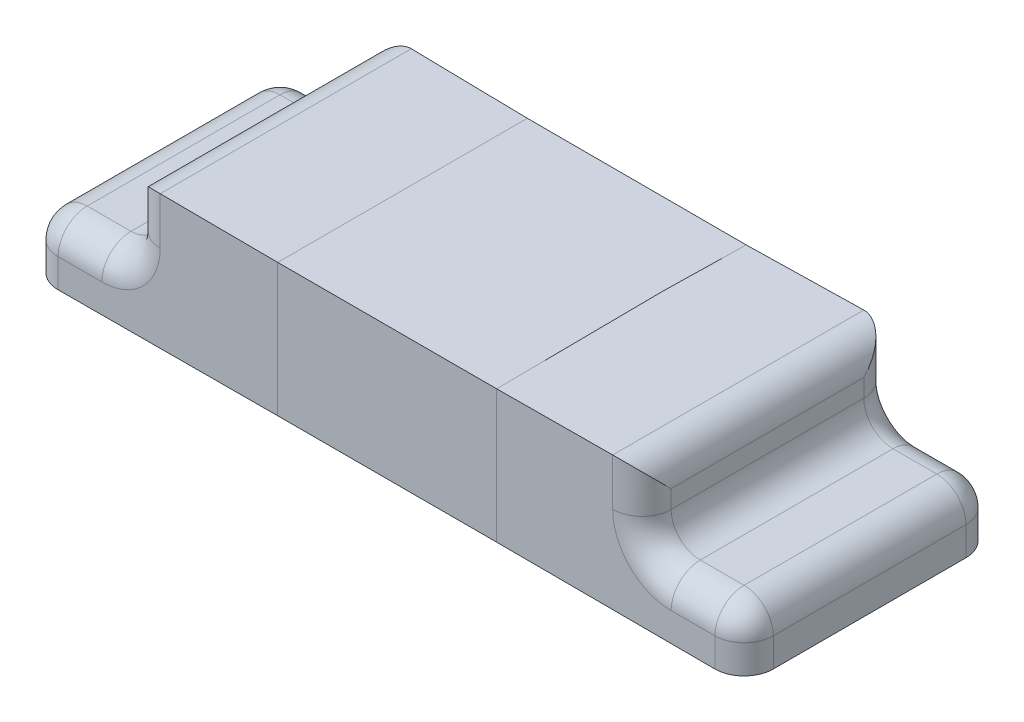
ISO-10303-21;
HEADER;
FILE_DESCRIPTION(('STEP AP214'),'2;1');
FILE_NAME('part.step','',(''),(''),'','','');
FILE_SCHEMA(('AUTOMOTIVE_DESIGN { 1 0 10303 214 1 1 1 1 }'));
ENDSEC;
DATA;
#1=APPLICATION_CONTEXT('core data for automotive mechanical design processes');
#2=APPLICATION_PROTOCOL_DEFINITION('international standard','automotive_design',2000,#1);
#3=PRODUCT_CONTEXT('',#1,'mechanical');
#4=PRODUCT('Part','Part','',(#3));
#5=PRODUCT_RELATED_PRODUCT_CATEGORY('part','',(#4));
#6=PRODUCT_DEFINITION_FORMATION('','',#4);
#7=PRODUCT_DEFINITION_CONTEXT('part definition',#1,'design');
#8=PRODUCT_DEFINITION('design','',#6,#7);
#9=PRODUCT_DEFINITION_SHAPE('','',#8);
#10=(LENGTH_UNIT() NAMED_UNIT(*) SI_UNIT(.MILLI.,.METRE.));
#11=(NAMED_UNIT(*) PLANE_ANGLE_UNIT() SI_UNIT($,.RADIAN.));
#12=(NAMED_UNIT(*) SI_UNIT($,.STERADIAN.) SOLID_ANGLE_UNIT());
#13=UNCERTAINTY_MEASURE_WITH_UNIT(LENGTH_MEASURE(1.E-05),#10,'distance_accuracy_value','');
#14=(GEOMETRIC_REPRESENTATION_CONTEXT(3) GLOBAL_UNCERTAINTY_ASSIGNED_CONTEXT((#13)) GLOBAL_UNIT_ASSIGNED_CONTEXT((#10,
#11,#12)) REPRESENTATION_CONTEXT('',''));
#15=CARTESIAN_POINT('',(0.,0.,0.));
#16=DIRECTION('',(0.,0.,1.));
#17=DIRECTION('',(1.,0.,0.));
#18=AXIS2_PLACEMENT_3D('',#15,#16,#17);
#19=CARTESIAN_POINT('',(0.875,0.,0.));
#20=DIRECTION('',(-1.,0.,0.));
#21=DIRECTION('',(0.,0.,1.));
#22=AXIS2_PLACEMENT_3D('',#19,#20,#21);
#23=PLANE('',#22);
#24=DIRECTION('',(0.,1.,0.));
#25=VECTOR('',#24,1.);
#26=CARTESIAN_POINT('',(0.875,0.,-0.33));
#27=LINE('',#26,#25);
#28=CARTESIAN_POINT('',(0.875,0.298442990090282,-0.33));
#29=VERTEX_POINT('',#28);
#30=CARTESIAN_POINT('',(0.875,0.36,-0.33));
#31=VERTEX_POINT('',#30);
#32=EDGE_CURVE('E507',#29,#31,#27,.T.);
#33=ORIENTED_EDGE('',*,*,#32,.T.);
#34=DIRECTION('',(0.,0.,1.));
#35=VECTOR('',#34,1.);
#36=CARTESIAN_POINT('',(0.875,0.36,0.));
#37=LINE('',#36,#35);
#38=CARTESIAN_POINT('',(0.875,0.36,0.33));
#39=VERTEX_POINT('',#38);
#40=EDGE_CURVE('E482',#31,#39,#37,.T.);
#41=ORIENTED_EDGE('',*,*,#40,.T.);
#42=DIRECTION('',(0.,-1.,0.));
#43=VECTOR('',#42,1.);
#44=CARTESIAN_POINT('',(0.875,0.,0.33));
#45=LINE('',#44,#43);
#46=CARTESIAN_POINT('',(0.875,0.298442990090282,0.33));
#47=VERTEX_POINT('',#46);
#48=EDGE_CURVE('E510',#39,#47,#45,.T.);
#49=ORIENTED_EDGE('',*,*,#48,.T.);
#50=DIRECTION('',(0.,0.,1.));
#51=VECTOR('',#50,1.);
#52=CARTESIAN_POINT('',(0.875,0.298442990090282,-0.43));
#53=LINE('',#52,#51);
#54=EDGE_CURVE('E272',#47,#29,#53,.F.);
#55=ORIENTED_EDGE('',*,*,#54,.T.);
#56=EDGE_LOOP('',(#33,#41,#49,#55));
#57=FACE_BOUND('',#56,.T.);
#58=ADVANCED_FACE('F39',(#57),#23,.F.);
#59=CARTESIAN_POINT('',(0.375,0.,-0.425));
#60=DIRECTION('',(0.,0.,1.));
#61=DIRECTION('',(1.,0.,0.));
#62=AXIS2_PLACEMENT_3D('',#59,#60,#61);
#63=PLANE('',#62);
#64=CARTESIAN_POINT('',(-0.375,0.,-0.425));
#65=DIRECTION('',(0.,1.,0.));
#66=VECTOR('',#65,1.);
#67=LINE('',#64,#66);
#68=CARTESIAN_POINT('',(-0.375,0.,-0.4275));
#69=VERTEX_POINT('',#68);
#70=CARTESIAN_POINT('',(-0.375,0.455,-0.4275));
#71=VERTEX_POINT('',#70);
#72=EDGE_CURVE('E232',#69,#71,#67,.T.);
#73=ORIENTED_EDGE('',*,*,#72,.T.);
#74=DIRECTION('',(-1.,0.,0.));
#75=VECTOR('',#74,1.);
#76=CARTESIAN_POINT('',(0.375,0.45,-0.425));
#77=LINE('',#76,#75);
#78=CARTESIAN_POINT('',(0.375,0.454472135955,-0.4272360679775));
#79=VERTEX_POINT('',#78);
#80=EDGE_CURVE('E269',#79,#71,#77,.T.);
#81=ORIENTED_EDGE('',*,*,#80,.F.);
#82=CARTESIAN_POINT('',(0.375,0.,-0.43));
#83=DIRECTION('',(0.,1.,0.));
#84=VECTOR('',#83,1.);
#85=LINE('',#82,#84);
#86=CARTESIAN_POINT('',(0.375,0.,-0.4275));
#87=VERTEX_POINT('',#86);
#88=EDGE_CURVE('E248',#87,#79,#85,.T.);
#89=ORIENTED_EDGE('',*,*,#88,.F.);
#90=DIRECTION('',(-1.,0.,0.));
#91=VECTOR('',#90,1.);
#92=CARTESIAN_POINT('',(0.375,0.,-0.425));
#93=LINE('',#92,#91);
#94=EDGE_CURVE('E221',#87,#69,#93,.T.);
#95=ORIENTED_EDGE('',*,*,#94,.T.);
#96=EDGE_LOOP('',(#73,#81,#89,#95));
#97=FACE_BOUND('',#96,.T.);
#98=ADVANCED_FACE('F246',(#97),#63,.F.);
#99=CARTESIAN_POINT('',(0.375,0.45,0.425));
#100=DIRECTION('',(0.,-1.,0.));
#101=DIRECTION('',(0.,0.,-1.));
#102=AXIS2_PLACEMENT_3D('',#99,#100,#101);
#103=PLANE('',#102);
#104=CARTESIAN_POINT('',(-0.375,0.45,-0.425));
#105=DIRECTION('',(0.,0.,1.));
#106=VECTOR('',#105,1.);
#107=LINE('',#104,#106);
#108=CARTESIAN_POINT('',(-0.375,0.455,0.4275));
#109=VERTEX_POINT('',#108);
#110=EDGE_CURVE('E242',#71,#109,#107,.T.);
#111=ORIENTED_EDGE('',*,*,#110,.T.);
#112=DIRECTION('',(-1.,0.,0.));
#113=VECTOR('',#112,1.);
#114=CARTESIAN_POINT('',(0.375,0.45,0.425));
#115=LINE('',#114,#113);
#116=CARTESIAN_POINT('',(0.375,0.455,0.4275));
#117=VERTEX_POINT('',#116);
#118=EDGE_CURVE('E254',#117,#109,#115,.T.);
#119=ORIENTED_EDGE('',*,*,#118,.F.);
#120=DIRECTION('',(0.,0.,1.));
#121=VECTOR('',#120,1.);
#122=CARTESIAN_POINT('',(0.375,0.45,0.425));
#123=LINE('',#122,#121);
#124=EDGE_CURVE('E257',#79,#117,#123,.T.);
#125=ORIENTED_EDGE('',*,*,#124,.F.);
#126=ORIENTED_EDGE('',*,*,#80,.T.);
#127=EDGE_LOOP('',(#111,#119,#125,#126));
#128=FACE_BOUND('',#127,.T.);
#129=ADVANCED_FACE('F296',(#128),#103,.F.);
#130=CARTESIAN_POINT('',(0.375,0.,0.425));
#131=DIRECTION('',(0.,0.,-1.));
#132=DIRECTION('',(-1.,0.,0.));
#133=AXIS2_PLACEMENT_3D('',#130,#131,#132);
#134=PLANE('',#133);
#135=CARTESIAN_POINT('',(-0.375,0.45,0.425));
#136=DIRECTION('',(0.,-1.,0.));
#137=VECTOR('',#136,1.);
#138=LINE('',#135,#137);
#139=CARTESIAN_POINT('',(-0.375,0.,0.4275));
#140=VERTEX_POINT('',#139);
#141=EDGE_CURVE('E337',#109,#140,#138,.T.);
#142=ORIENTED_EDGE('',*,*,#141,.T.);
#143=DIRECTION('',(-1.,0.,0.));
#144=VECTOR('',#143,1.);
#145=CARTESIAN_POINT('',(0.375,0.,0.425));
#146=LINE('',#145,#144);
#147=CARTESIAN_POINT('',(0.375,0.,0.4275));
#148=VERTEX_POINT('',#147);
#149=EDGE_CURVE('E250',#148,#140,#146,.T.);
#150=ORIENTED_EDGE('',*,*,#149,.F.);
#151=CARTESIAN_POINT('',(0.375,0.46,0.43));
#152=DIRECTION('',(0.,-1.,0.));
#153=VECTOR('',#152,1.);
#154=LINE('',#151,#153);
#155=EDGE_CURVE('E251',#117,#148,#154,.T.);
#156=ORIENTED_EDGE('',*,*,#155,.F.);
#157=ORIENTED_EDGE('',*,*,#118,.T.);
#158=EDGE_LOOP('',(#142,#150,#156,#157));
#159=FACE_BOUND('',#158,.T.);
#160=ADVANCED_FACE('F286',(#159),#134,.F.);
#161=CARTESIAN_POINT('',(0.375,0.,0.425));
#162=DIRECTION('',(0.,1.,0.));
#163=DIRECTION('',(0.,0.,1.));
#164=AXIS2_PLACEMENT_3D('',#161,#162,#163);
#165=PLANE('',#164);
#166=DIRECTION('',(0.,0.,-1.));
#167=VECTOR('',#166,1.);
#168=CARTESIAN_POINT('',(-1.225,0.,0.43));
#169=LINE('',#168,#167);
#170=CARTESIAN_POINT('',(-1.225,0.,0.33));
#171=VERTEX_POINT('',#170);
#172=CARTESIAN_POINT('',(-1.225,0.,-0.33));
#173=VERTEX_POINT('',#172);
#174=EDGE_CURVE('E326',#171,#173,#169,.T.);
#175=ORIENTED_EDGE('',*,*,#174,.T.);
#176=CARTESIAN_POINT('',(-1.125,0.,-0.33));
#177=DIRECTION('',(0.,1.,0.));
#178=DIRECTION('',(0.,0.,1.));
#179=AXIS2_PLACEMENT_3D('',#176,#177,#178);
#180=CIRCLE('',#179,0.1);
#181=CARTESIAN_POINT('',(-1.125,0.,-0.43));
#182=VERTEX_POINT('',#181);
#183=EDGE_CURVE('E224',#173,#182,#180,.F.);
#184=ORIENTED_EDGE('',*,*,#183,.T.);
#185=DIRECTION('',(1.,0.,0.));
#186=VECTOR('',#185,1.);
#187=CARTESIAN_POINT('',(-0.875,0.,-0.43));
#188=LINE('',#187,#186);
#189=EDGE_CURVE('E215',#182,#69,#188,.T.);
#190=ORIENTED_EDGE('',*,*,#189,.T.);
#191=ORIENTED_EDGE('',*,*,#94,.F.);
#192=DIRECTION('',(-1.,0.,0.));
#193=VECTOR('',#192,1.);
#194=CARTESIAN_POINT('',(0.875,0.,-0.43));
#195=LINE('',#194,#193);
#196=CARTESIAN_POINT('',(1.125,0.,-0.43));
#197=VERTEX_POINT('',#196);
#198=EDGE_CURVE('E464',#197,#87,#195,.T.);
#199=ORIENTED_EDGE('',*,*,#198,.F.);
#200=CARTESIAN_POINT('',(1.125,0.,-0.33));
#201=DIRECTION('',(0.,1.,0.));
#202=DIRECTION('',(0.,0.,1.));
#203=AXIS2_PLACEMENT_3D('',#200,#201,#202);
#204=CIRCLE('',#203,0.1);
#205=CARTESIAN_POINT('',(1.225,0.,-0.33));
#206=VERTEX_POINT('',#205);
#207=EDGE_CURVE('E662',#197,#206,#204,.F.);
#208=ORIENTED_EDGE('',*,*,#207,.T.);
#209=DIRECTION('',(0.,0.,-1.));
#210=VECTOR('',#209,1.);
#211=CARTESIAN_POINT('',(1.225,0.,0.43));
#212=LINE('',#211,#210);
#213=CARTESIAN_POINT('',(1.225,0.,0.33));
#214=VERTEX_POINT('',#213);
#215=EDGE_CURVE('E457',#214,#206,#212,.T.);
#216=ORIENTED_EDGE('',*,*,#215,.F.);
#217=CARTESIAN_POINT('',(1.125,0.,0.33));
#218=DIRECTION('',(0.,1.,0.));
#219=DIRECTION('',(0.,0.,1.));
#220=AXIS2_PLACEMENT_3D('',#217,#218,#219);
#221=CIRCLE('',#220,0.1);
#222=CARTESIAN_POINT('',(1.125,0.,0.43));
#223=VERTEX_POINT('',#222);
#224=EDGE_CURVE('E658',#214,#223,#221,.F.);
#225=ORIENTED_EDGE('',*,*,#224,.T.);
#226=DIRECTION('',(-1.,0.,0.));
#227=VECTOR('',#226,1.);
#228=CARTESIAN_POINT('',(0.875,0.,0.43));
#229=LINE('',#228,#227);
#230=EDGE_CURVE('E408',#223,#148,#229,.T.);
#231=ORIENTED_EDGE('',*,*,#230,.T.);
#232=ORIENTED_EDGE('',*,*,#149,.T.);
#233=DIRECTION('',(1.,0.,0.));
#234=VECTOR('',#233,1.);
#235=CARTESIAN_POINT('',(-0.875,0.,0.43));
#236=LINE('',#235,#234);
#237=CARTESIAN_POINT('',(-1.125,0.,0.43));
#238=VERTEX_POINT('',#237);
#239=EDGE_CURVE('E229',#238,#140,#236,.T.);
#240=ORIENTED_EDGE('',*,*,#239,.F.);
#241=CARTESIAN_POINT('',(-1.125,0.,0.33));
#242=DIRECTION('',(0.,1.,0.));
#243=DIRECTION('',(0.,0.,1.));
#244=AXIS2_PLACEMENT_3D('',#241,#242,#243);
#245=CIRCLE('',#244,0.1);
#246=EDGE_CURVE('E62',#238,#171,#245,.F.);
#247=ORIENTED_EDGE('',*,*,#246,.T.);
#248=EDGE_LOOP('',(#175,#184,#190,#191,#199,#208,#216,#225,#231,#232,#240,#247));
#249=FACE_BOUND('',#248,.T.);
#250=ADVANCED_FACE('F218',(#249),#165,.F.);
#251=CARTESIAN_POINT('',(0.875,0.,-0.43));
#252=DIRECTION('',(0.,0.,1.));
#253=DIRECTION('',(1.,0.,0.));
#254=AXIS2_PLACEMENT_3D('',#251,#252,#253);
#255=PLANE('',#254);
#256=DIRECTION('',(-1.,0.,0.));
#257=VECTOR('',#256,1.);
#258=CARTESIAN_POINT('',(0.875,0.098442990090282,-0.43));
#259=LINE('',#258,#257);
#260=CARTESIAN_POINT('',(0.975,0.098442990090282,-0.43));
#261=VERTEX_POINT('',#260);
#262=CARTESIAN_POINT('',(1.125,0.098442990090282,-0.43));
#263=VERTEX_POINT('',#262);
#264=EDGE_CURVE('E484',#261,#263,#259,.F.);
#265=ORIENTED_EDGE('',*,*,#264,.T.);
#266=DIRECTION('',(0.,1.,0.));
#267=VECTOR('',#266,1.);
#268=CARTESIAN_POINT('',(1.125,0.,-0.43));
#269=LINE('',#268,#267);
#270=EDGE_CURVE('E463',#263,#197,#269,.F.);
#271=ORIENTED_EDGE('',*,*,#270,.T.);
#272=ORIENTED_EDGE('',*,*,#198,.T.);
#273=ORIENTED_EDGE('',*,*,#88,.T.);
#274=DIRECTION('',(-1.,0.,0.));
#275=VECTOR('',#274,1.);
#276=CARTESIAN_POINT('',(0.875,0.46,-0.43));
#277=LINE('',#276,#275);
#278=CARTESIAN_POINT('',(0.775,0.46,-0.43));
#279=VERTEX_POINT('',#278);
#280=EDGE_CURVE('E243',#279,#79,#277,.T.);
#281=ORIENTED_EDGE('',*,*,#280,.F.);
#282=DIRECTION('',(0.,1.,0.));
#283=VECTOR('',#282,1.);
#284=CARTESIAN_POINT('',(0.775,0.,-0.43));
#285=LINE('',#284,#283);
#286=CARTESIAN_POINT('',(0.775,0.298442990090282,-0.43));
#287=VERTEX_POINT('',#286);
#288=EDGE_CURVE('E409',#279,#287,#285,.F.);
#289=ORIENTED_EDGE('',*,*,#288,.T.);
#290=CARTESIAN_POINT('',(0.975,0.298442990090282,-0.43));
#291=DIRECTION('',(0.,0.,1.));
#292=DIRECTION('',(1.,0.,0.));
#293=AXIS2_PLACEMENT_3D('',#290,#291,#292);
#294=CIRCLE('',#293,0.2);
#295=EDGE_CURVE('E486',#261,#287,#294,.F.);
#296=ORIENTED_EDGE('',*,*,#295,.F.);
#297=EDGE_LOOP('',(#265,#271,#272,#273,#281,#289,#296));
#298=FACE_BOUND('',#297,.T.);
#299=ADVANCED_FACE('F494',(#298),#255,.F.);
#300=CARTESIAN_POINT('',(0.875,0.46,0.43));
#301=DIRECTION('',(0.,-1.,0.));
#302=DIRECTION('',(0.,0.,-1.));
#303=AXIS2_PLACEMENT_3D('',#300,#301,#302);
#304=PLANE('',#303);
#305=DIRECTION('',(-1.,0.,0.));
#306=VECTOR('',#305,1.);
#307=CARTESIAN_POINT('',(0.875,0.46,0.43));
#308=LINE('',#307,#306);
#309=CARTESIAN_POINT('',(0.775,0.46,0.43));
#310=VERTEX_POINT('',#309);
#311=EDGE_CURVE('E405',#310,#117,#308,.T.);
#312=ORIENTED_EDGE('',*,*,#311,.F.);
#313=DIRECTION('',(0.,0.,1.));
#314=VECTOR('',#313,1.);
#315=CARTESIAN_POINT('',(0.775,0.46,0.43));
#316=LINE('',#315,#314);
#317=EDGE_CURVE('E418',#310,#279,#316,.F.);
#318=ORIENTED_EDGE('',*,*,#317,.T.);
#319=ORIENTED_EDGE('',*,*,#280,.T.);
#320=DIRECTION('',(0.,0.,1.));
#321=VECTOR('',#320,1.);
#322=CARTESIAN_POINT('',(0.375,0.46,0.43));
#323=LINE('',#322,#321);
#324=EDGE_CURVE('E467',#79,#117,#323,.T.);
#325=ORIENTED_EDGE('',*,*,#324,.T.);
#326=EDGE_LOOP('',(#312,#318,#319,#325));
#327=FACE_BOUND('',#326,.T.);
#328=ADVANCED_FACE('F388',(#327),#304,.F.);
#329=CARTESIAN_POINT('',(0.875,0.,0.43));
#330=DIRECTION('',(0.,0.,-1.));
#331=DIRECTION('',(-1.,0.,0.));
#332=AXIS2_PLACEMENT_3D('',#329,#330,#331);
#333=PLANE('',#332);
#334=ORIENTED_EDGE('',*,*,#230,.F.);
#335=DIRECTION('',(0.,-1.,0.));
#336=VECTOR('',#335,1.);
#337=CARTESIAN_POINT('',(1.125,0.,0.43));
#338=LINE('',#337,#336);
#339=CARTESIAN_POINT('',(1.125,0.098442990090282,0.43));
#340=VERTEX_POINT('',#339);
#341=EDGE_CURVE('E664',#223,#340,#338,.F.);
#342=ORIENTED_EDGE('',*,*,#341,.T.);
#343=DIRECTION('',(-1.,0.,0.));
#344=VECTOR('',#343,1.);
#345=CARTESIAN_POINT('',(0.875,0.098442990090282,0.43));
#346=LINE('',#345,#344);
#347=CARTESIAN_POINT('',(0.975,0.098442990090282,0.43));
#348=VERTEX_POINT('',#347);
#349=EDGE_CURVE('E414',#340,#348,#346,.T.);
#350=ORIENTED_EDGE('',*,*,#349,.T.);
#351=CARTESIAN_POINT('',(0.975,0.298442990090282,0.43));
#352=DIRECTION('',(0.,0.,-1.));
#353=DIRECTION('',(-1.,0.,0.));
#354=AXIS2_PLACEMENT_3D('',#351,#352,#353);
#355=CIRCLE('',#354,0.2);
#356=CARTESIAN_POINT('',(0.775,0.298442990090282,0.43));
#357=VERTEX_POINT('',#356);
#358=EDGE_CURVE('E411',#357,#348,#355,.F.);
#359=ORIENTED_EDGE('',*,*,#358,.F.);
#360=DIRECTION('',(0.,-1.,0.));
#361=VECTOR('',#360,1.);
#362=CARTESIAN_POINT('',(0.775,0.,0.43));
#363=LINE('',#362,#361);
#364=EDGE_CURVE('E416',#357,#310,#363,.F.);
#365=ORIENTED_EDGE('',*,*,#364,.T.);
#366=ORIENTED_EDGE('',*,*,#311,.T.);
#367=ORIENTED_EDGE('',*,*,#155,.T.);
#368=EDGE_LOOP('',(#334,#342,#350,#359,#365,#366,#367));
#369=FACE_BOUND('',#368,.T.);
#370=ADVANCED_FACE('F383',(#369),#333,.F.);
#371=CARTESIAN_POINT('',(0.375,0.,0.));
#372=DIRECTION('',(-1.,0.,0.));
#373=DIRECTION('',(0.,0.,1.));
#374=AXIS2_PLACEMENT_3D('',#371,#372,#373);
#375=PLANE('',#374);
#376=ORIENTED_EDGE('',*,*,#324,.F.);
#377=ORIENTED_EDGE('',*,*,#124,.T.);
#378=EDGE_LOOP('',(#376,#377));
#379=FACE_BOUND('',#378,.T.);
#380=ADVANCED_FACE('F376',(#379),#375,.T.);
#381=CARTESIAN_POINT('',(1.225,0.198442990090282,0.43));
#382=DIRECTION('',(0.,-1.,0.));
#383=DIRECTION('',(0.,0.,-1.));
#384=AXIS2_PLACEMENT_3D('',#381,#382,#383);
#385=PLANE('',#384);
#386=DIRECTION('',(-1.,0.,0.));
#387=VECTOR('',#386,1.);
#388=CARTESIAN_POINT('',(1.225,0.198442990090282,-0.33));
#389=LINE('',#388,#387);
#390=CARTESIAN_POINT('',(1.125,0.198442990090282,-0.33));
#391=VERTEX_POINT('',#390);
#392=CARTESIAN_POINT('',(0.975,0.198442990090282,-0.33));
#393=VERTEX_POINT('',#392);
#394=EDGE_CURVE('E426',#391,#393,#389,.T.);
#395=ORIENTED_EDGE('',*,*,#394,.T.);
#396=DIRECTION('',(0.,0.,1.));
#397=VECTOR('',#396,1.);
#398=CARTESIAN_POINT('',(0.975,0.198442990090282,0.43));
#399=LINE('',#398,#397);
#400=CARTESIAN_POINT('',(0.975,0.198442990090282,0.33));
#401=VERTEX_POINT('',#400);
#402=EDGE_CURVE('E429',#393,#401,#399,.T.);
#403=ORIENTED_EDGE('',*,*,#402,.T.);
#404=DIRECTION('',(-1.,0.,0.));
#405=VECTOR('',#404,1.);
#406=CARTESIAN_POINT('',(1.225,0.198442990090282,0.33));
#407=LINE('',#406,#405);
#408=CARTESIAN_POINT('',(1.125,0.198442990090282,0.33));
#409=VERTEX_POINT('',#408);
#410=EDGE_CURVE('E423',#401,#409,#407,.F.);
#411=ORIENTED_EDGE('',*,*,#410,.T.);
#412=DIRECTION('',(0.,0.,1.));
#413=VECTOR('',#412,1.);
#414=CARTESIAN_POINT('',(1.125,0.198442990090282,0.43));
#415=LINE('',#414,#413);
#416=EDGE_CURVE('E420',#409,#391,#415,.F.);
#417=ORIENTED_EDGE('',*,*,#416,.T.);
#418=EDGE_LOOP('',(#395,#403,#411,#417));
#419=FACE_BOUND('',#418,.T.);
#420=ADVANCED_FACE('F372',(#419),#385,.F.);
#421=CARTESIAN_POINT('',(1.225,0.,0.));
#422=DIRECTION('',(-1.,0.,0.));
#423=DIRECTION('',(0.,0.,1.));
#424=AXIS2_PLACEMENT_3D('',#421,#422,#423);
#425=PLANE('',#424);
#426=ORIENTED_EDGE('',*,*,#215,.T.);
#427=DIRECTION('',(0.,1.,0.));
#428=VECTOR('',#427,1.);
#429=CARTESIAN_POINT('',(1.225,0.,-0.33));
#430=LINE('',#429,#428);
#431=CARTESIAN_POINT('',(1.225,0.098442990090282,-0.33));
#432=VERTEX_POINT('',#431);
#433=EDGE_CURVE('E460',#206,#432,#430,.T.);
#434=ORIENTED_EDGE('',*,*,#433,.T.);
#435=DIRECTION('',(0.,0.,1.));
#436=VECTOR('',#435,1.);
#437=CARTESIAN_POINT('',(1.225,0.098442990090282,0.));
#438=LINE('',#437,#436);
#439=CARTESIAN_POINT('',(1.225,0.098442990090282,0.33));
#440=VERTEX_POINT('',#439);
#441=EDGE_CURVE('E431',#432,#440,#438,.T.);
#442=ORIENTED_EDGE('',*,*,#441,.T.);
#443=DIRECTION('',(0.,-1.,0.));
#444=VECTOR('',#443,1.);
#445=CARTESIAN_POINT('',(1.225,0.,0.33));
#446=LINE('',#445,#444);
#447=EDGE_CURVE('E434',#440,#214,#446,.T.);
#448=ORIENTED_EDGE('',*,*,#447,.T.);
#449=EDGE_LOOP('',(#426,#434,#442,#448));
#450=FACE_BOUND('',#449,.T.);
#451=ADVANCED_FACE('F361',(#450),#425,.F.);
#452=CARTESIAN_POINT('',(0.875,0.098442990090282,0.33));
#453=DIRECTION('',(-1.,0.,0.));
#454=DIRECTION('',(0.,0.,1.));
#455=AXIS2_PLACEMENT_3D('',#452,#453,#454);
#456=CYLINDRICAL_SURFACE('',#455,0.1);
#457=ORIENTED_EDGE('',*,*,#349,.F.);
#458=CARTESIAN_POINT('',(1.125,0.098442990090282,0.33));
#459=DIRECTION('',(-1.,0.,0.));
#460=DIRECTION('',(0.,0.,1.));
#461=AXIS2_PLACEMENT_3D('',#458,#459,#460);
#462=CIRCLE('',#461,0.1);
#463=EDGE_CURVE('E672',#340,#409,#462,.T.);
#464=ORIENTED_EDGE('',*,*,#463,.T.);
#465=ORIENTED_EDGE('',*,*,#410,.F.);
#466=CARTESIAN_POINT('',(0.975,0.098442990090282,0.33));
#467=DIRECTION('',(-1.,0.,0.));
#468=DIRECTION('',(0.,0.,1.));
#469=AXIS2_PLACEMENT_3D('',#466,#467,#468);
#470=CIRCLE('',#469,0.1);
#471=EDGE_CURVE('E454',#348,#401,#470,.T.);
#472=ORIENTED_EDGE('',*,*,#471,.F.);
#473=EDGE_LOOP('',(#457,#464,#465,#472));
#474=FACE_BOUND('',#473,.T.);
#475=ADVANCED_FACE('F371',(#474),#456,.T.);
#476=CARTESIAN_POINT('',(1.125,0.098442990090282,0.));
#477=DIRECTION('',(0.,0.,1.));
#478=DIRECTION('',(1.,0.,0.));
#479=AXIS2_PLACEMENT_3D('',#476,#477,#478);
#480=CYLINDRICAL_SURFACE('',#479,0.1);
#481=ORIENTED_EDGE('',*,*,#441,.F.);
#482=CARTESIAN_POINT('',(1.125,0.098442990090282,-0.33));
#483=DIRECTION('',(0.,0.,1.));
#484=DIRECTION('',(1.,0.,0.));
#485=AXIS2_PLACEMENT_3D('',#482,#483,#484);
#486=CIRCLE('',#485,0.1);
#487=EDGE_CURVE('E670',#432,#391,#486,.T.);
#488=ORIENTED_EDGE('',*,*,#487,.T.);
#489=ORIENTED_EDGE('',*,*,#416,.F.);
#490=CARTESIAN_POINT('',(1.125,0.098442990090282,0.33));
#491=DIRECTION('',(0.,0.,1.));
#492=DIRECTION('',(1.,0.,0.));
#493=AXIS2_PLACEMENT_3D('',#490,#491,#492);
#494=CIRCLE('',#493,0.1);
#495=EDGE_CURVE('E668',#409,#440,#494,.F.);
#496=ORIENTED_EDGE('',*,*,#495,.T.);
#497=EDGE_LOOP('',(#481,#488,#489,#496));
#498=FACE_BOUND('',#497,.T.);
#499=ADVANCED_FACE('F547',(#498),#480,.T.);
#500=CARTESIAN_POINT('',(0.975,0.298442990090282,0.33));
#501=DIRECTION('',(0.,0.,-1.));
#502=DIRECTION('',(-1.,0.,0.));
#503=AXIS2_PLACEMENT_3D('',#500,#501,#502);
#504=TOROIDAL_SURFACE('',#503,0.2,0.1);
#505=ORIENTED_EDGE('',*,*,#358,.T.);
#506=ORIENTED_EDGE('',*,*,#471,.T.);
#507=CARTESIAN_POINT('',(0.975,0.298442990090282,0.33));
#508=DIRECTION('',(0.,0.,-1.));
#509=DIRECTION('',(-1.,0.,0.));
#510=AXIS2_PLACEMENT_3D('',#507,#508,#509);
#511=CIRCLE('',#510,0.1);
#512=EDGE_CURVE('E451',#47,#401,#511,.F.);
#513=ORIENTED_EDGE('',*,*,#512,.F.);
#514=CARTESIAN_POINT('',(0.775,0.298442990090282,0.33));
#515=DIRECTION('',(0.,-1.,0.));
#516=DIRECTION('',(0.,0.,-1.));
#517=AXIS2_PLACEMENT_3D('',#514,#515,#516);
#518=CIRCLE('',#517,0.1);
#519=EDGE_CURVE('E448',#357,#47,#518,.F.);
#520=ORIENTED_EDGE('',*,*,#519,.F.);
#521=EDGE_LOOP('',(#505,#506,#513,#520));
#522=FACE_BOUND('',#521,.T.);
#523=ADVANCED_FACE('F522',(#522),#504,.T.);
#524=CARTESIAN_POINT('',(1.225,0.098442990090282,-0.33));
#525=DIRECTION('',(-1.,0.,0.));
#526=DIRECTION('',(0.,0.,1.));
#527=AXIS2_PLACEMENT_3D('',#524,#525,#526);
#528=CYLINDRICAL_SURFACE('',#527,0.1);
#529=ORIENTED_EDGE('',*,*,#394,.F.);
#530=CARTESIAN_POINT('',(1.125,0.098442990090282,-0.33));
#531=DIRECTION('',(-1.,0.,0.));
#532=DIRECTION('',(0.,0.,1.));
#533=AXIS2_PLACEMENT_3D('',#530,#531,#532);
#534=CIRCLE('',#533,0.1);
#535=EDGE_CURVE('E666',#391,#263,#534,.T.);
#536=ORIENTED_EDGE('',*,*,#535,.T.);
#537=ORIENTED_EDGE('',*,*,#264,.F.);
#538=CARTESIAN_POINT('',(0.975,0.098442990090282,-0.33));
#539=DIRECTION('',(-1.,0.,0.));
#540=DIRECTION('',(0.,0.,1.));
#541=AXIS2_PLACEMENT_3D('',#538,#539,#540);
#542=CIRCLE('',#541,0.1);
#543=EDGE_CURVE('E445',#393,#261,#542,.T.);
#544=ORIENTED_EDGE('',*,*,#543,.F.);
#545=EDGE_LOOP('',(#529,#536,#537,#544));
#546=FACE_BOUND('',#545,.T.);
#547=ADVANCED_FACE('F541',(#546),#528,.T.);
#548=CARTESIAN_POINT('',(0.975,0.298442990090282,0.43));
#549=DIRECTION('',(0.,0.,-1.));
#550=DIRECTION('',(-1.,0.,0.));
#551=AXIS2_PLACEMENT_3D('',#548,#549,#550);
#552=CYLINDRICAL_SURFACE('',#551,0.1);
#553=ORIENTED_EDGE('',*,*,#512,.T.);
#554=ORIENTED_EDGE('',*,*,#402,.F.);
#555=CARTESIAN_POINT('',(0.975,0.298442990090282,-0.33));
#556=DIRECTION('',(0.,0.,1.));
#557=DIRECTION('',(1.,0.,0.));
#558=AXIS2_PLACEMENT_3D('',#555,#556,#557);
#559=CIRCLE('',#558,0.1);
#560=EDGE_CURVE('E443',#29,#393,#559,.T.);
#561=ORIENTED_EDGE('',*,*,#560,.F.);
#562=ORIENTED_EDGE('',*,*,#54,.F.);
#563=EDGE_LOOP('',(#553,#554,#561,#562));
#564=FACE_BOUND('',#563,.T.);
#565=ADVANCED_FACE('F526',(#564),#552,.F.);
#566=CARTESIAN_POINT('',(0.775,0.,0.33));
#567=DIRECTION('',(0.,-1.,0.));
#568=DIRECTION('',(0.,0.,-1.));
#569=AXIS2_PLACEMENT_3D('',#566,#567,#568);
#570=CYLINDRICAL_SURFACE('',#569,0.1);
#571=ORIENTED_EDGE('',*,*,#519,.T.);
#572=ORIENTED_EDGE('',*,*,#48,.F.);
#573=CARTESIAN_POINT('',(0.775,0.36,0.33));
#574=DIRECTION('',(0.,-0.707106781186547,0.707106781186547));
#575=DIRECTION('',(0.,0.707106781186547,0.707106781186547));
#576=AXIS2_PLACEMENT_3D('',#573,#574,#575);
#577=ELLIPSE('',#576,0.14142135623731,0.1);
#578=EDGE_CURVE('E440',#310,#39,#577,.F.);
#579=ORIENTED_EDGE('',*,*,#578,.F.);
#580=ORIENTED_EDGE('',*,*,#364,.F.);
#581=EDGE_LOOP('',(#571,#572,#579,#580));
#582=FACE_BOUND('',#581,.T.);
#583=ADVANCED_FACE('F520',(#582),#570,.T.);
#584=CARTESIAN_POINT('',(0.975,0.298442990090282,-0.33));
#585=DIRECTION('',(0.,0.,1.));
#586=DIRECTION('',(1.,0.,0.));
#587=AXIS2_PLACEMENT_3D('',#584,#585,#586);
#588=TOROIDAL_SURFACE('',#587,0.2,0.1);
#589=ORIENTED_EDGE('',*,*,#543,.T.);
#590=ORIENTED_EDGE('',*,*,#295,.T.);
#591=CARTESIAN_POINT('',(0.775,0.298442990090282,-0.33));
#592=DIRECTION('',(0.,-1.,0.));
#593=DIRECTION('',(0.,0.,-1.));
#594=AXIS2_PLACEMENT_3D('',#591,#592,#593);
#595=CIRCLE('',#594,0.1);
#596=EDGE_CURVE('E437',#29,#287,#595,.F.);
#597=ORIENTED_EDGE('',*,*,#596,.F.);
#598=ORIENTED_EDGE('',*,*,#560,.T.);
#599=EDGE_LOOP('',(#589,#590,#597,#598));
#600=FACE_BOUND('',#599,.T.);
#601=ADVANCED_FACE('F528',(#600),#588,.T.);
#602=CARTESIAN_POINT('',(0.775,0.36,0.));
#603=DIRECTION('',(0.,0.,1.));
#604=DIRECTION('',(1.,0.,0.));
#605=AXIS2_PLACEMENT_3D('',#602,#603,#604);
#606=CYLINDRICAL_SURFACE('',#605,0.1);
#607=ORIENTED_EDGE('',*,*,#578,.T.);
#608=ORIENTED_EDGE('',*,*,#40,.F.);
#609=CARTESIAN_POINT('',(0.775,0.36,-0.33));
#610=DIRECTION('',(0.,0.707106781186547,0.707106781186547));
#611=DIRECTION('',(0.,-0.707106781186547,0.707106781186547));
#612=AXIS2_PLACEMENT_3D('',#609,#610,#611);
#613=ELLIPSE('',#612,0.14142135623731,0.1);
#614=EDGE_CURVE('E435',#279,#31,#613,.F.);
#615=ORIENTED_EDGE('',*,*,#614,.F.);
#616=ORIENTED_EDGE('',*,*,#317,.F.);
#617=EDGE_LOOP('',(#607,#608,#615,#616));
#618=FACE_BOUND('',#617,.T.);
#619=ADVANCED_FACE('F503',(#618),#606,.T.);
#620=CARTESIAN_POINT('',(0.775,0.,-0.33));
#621=DIRECTION('',(0.,1.,0.));
#622=DIRECTION('',(0.,0.,1.));
#623=AXIS2_PLACEMENT_3D('',#620,#621,#622);
#624=CYLINDRICAL_SURFACE('',#623,0.1);
#625=ORIENTED_EDGE('',*,*,#596,.T.);
#626=ORIENTED_EDGE('',*,*,#288,.F.);
#627=ORIENTED_EDGE('',*,*,#614,.T.);
#628=ORIENTED_EDGE('',*,*,#32,.F.);
#629=EDGE_LOOP('',(#625,#626,#627,#628));
#630=FACE_BOUND('',#629,.T.);
#631=ADVANCED_FACE('F498',(#630),#624,.T.);
#632=CARTESIAN_POINT('',(1.125,0.098442990090282,-0.33));
#633=DIRECTION('',(0.,0.,1.));
#634=DIRECTION('',(1.,0.,0.));
#635=AXIS2_PLACEMENT_3D('',#632,#633,#634);
#636=SPHERICAL_SURFACE('',#635,0.1);
#637=ORIENTED_EDGE('',*,*,#535,.F.);
#638=ORIENTED_EDGE('',*,*,#487,.F.);
#639=CARTESIAN_POINT('',(1.125,0.098442990090282,-0.33));
#640=DIRECTION('',(0.,-1.,0.));
#641=DIRECTION('',(0.,0.,-1.));
#642=AXIS2_PLACEMENT_3D('',#639,#640,#641);
#643=CIRCLE('',#642,0.1);
#644=EDGE_CURVE('E438',#263,#432,#643,.T.);
#645=ORIENTED_EDGE('',*,*,#644,.F.);
#646=EDGE_LOOP('',(#637,#638,#645));
#647=FACE_BOUND('',#646,.T.);
#648=ADVANCED_FACE('F558',(#647),#636,.T.);
#649=CARTESIAN_POINT('',(1.125,0.,-0.33));
#650=DIRECTION('',(0.,1.,0.));
#651=DIRECTION('',(0.,0.,1.));
#652=AXIS2_PLACEMENT_3D('',#649,#650,#651);
#653=CYLINDRICAL_SURFACE('',#652,0.1);
#654=ORIENTED_EDGE('',*,*,#207,.F.);
#655=ORIENTED_EDGE('',*,*,#270,.F.);
#656=ORIENTED_EDGE('',*,*,#644,.T.);
#657=ORIENTED_EDGE('',*,*,#433,.F.);
#658=EDGE_LOOP('',(#654,#655,#656,#657));
#659=FACE_BOUND('',#658,.T.);
#660=ADVANCED_FACE('F554',(#659),#653,.T.);
#661=CARTESIAN_POINT('',(1.125,0.098442990090282,0.33));
#662=DIRECTION('',(0.,0.,1.));
#663=DIRECTION('',(1.,0.,0.));
#664=AXIS2_PLACEMENT_3D('',#661,#662,#663);
#665=SPHERICAL_SURFACE('',#664,0.1);
#666=ORIENTED_EDGE('',*,*,#495,.F.);
#667=ORIENTED_EDGE('',*,*,#463,.F.);
#668=CARTESIAN_POINT('',(1.125,0.098442990090282,0.33));
#669=DIRECTION('',(0.,-1.,0.));
#670=DIRECTION('',(0.,0.,-1.));
#671=AXIS2_PLACEMENT_3D('',#668,#669,#670);
#672=CIRCLE('',#671,0.1);
#673=EDGE_CURVE('E228',#440,#340,#672,.T.);
#674=ORIENTED_EDGE('',*,*,#673,.F.);
#675=EDGE_LOOP('',(#666,#667,#674));
#676=FACE_BOUND('',#675,.T.);
#677=ADVANCED_FACE('F557',(#676),#665,.T.);
#678=CARTESIAN_POINT('',(1.125,0.,0.33));
#679=DIRECTION('',(0.,-1.,0.));
#680=DIRECTION('',(0.,0.,-1.));
#681=AXIS2_PLACEMENT_3D('',#678,#679,#680);
#682=CYLINDRICAL_SURFACE('',#681,0.1);
#683=ORIENTED_EDGE('',*,*,#673,.T.);
#684=ORIENTED_EDGE('',*,*,#341,.F.);
#685=ORIENTED_EDGE('',*,*,#224,.F.);
#686=ORIENTED_EDGE('',*,*,#447,.F.);
#687=EDGE_LOOP('',(#683,#684,#685,#686));
#688=FACE_BOUND('',#687,.T.);
#689=ADVANCED_FACE('F360',(#688),#682,.T.);
#690=CARTESIAN_POINT('',(-0.875,0.,-0.43));
#691=DIRECTION('',(0.,0.,-1.));
#692=DIRECTION('',(-1.,0.,0.));
#693=AXIS2_PLACEMENT_3D('',#690,#691,#692);
#694=PLANE('',#693);
#695=ORIENTED_EDGE('',*,*,#189,.F.);
#696=DIRECTION('',(0.,1.,0.));
#697=VECTOR('',#696,1.);
#698=CARTESIAN_POINT('',(-1.125,0.098442990090282,-0.43));
#699=LINE('',#698,#697);
#700=CARTESIAN_POINT('',(-1.125,0.098442990090282,-0.43));
#701=VERTEX_POINT('',#700);
#702=EDGE_CURVE('E1064',#182,#701,#699,.T.);
#703=ORIENTED_EDGE('',*,*,#702,.T.);
#704=DIRECTION('',(1.,0.,0.));
#705=VECTOR('',#704,1.);
#706=CARTESIAN_POINT('',(-0.875,0.098442990090282,-0.43));
#707=LINE('',#706,#705);
#708=CARTESIAN_POINT('',(-0.975,0.098442990090282,-0.43));
#709=VERTEX_POINT('',#708);
#710=EDGE_CURVE('E1071',#701,#709,#707,.T.);
#711=ORIENTED_EDGE('',*,*,#710,.T.);
#712=CARTESIAN_POINT('',(-0.975,0.298442990090282,-0.43));
#713=DIRECTION('',(0.,0.,-1.));
#714=DIRECTION('',(-1.,0.,0.));
#715=AXIS2_PLACEMENT_3D('',#712,#713,#714);
#716=CIRCLE('',#715,0.2);
#717=CARTESIAN_POINT('',(-0.775,0.298442990090282,-0.43));
#718=VERTEX_POINT('',#717);
#719=EDGE_CURVE('E327',#718,#709,#716,.T.);
#720=ORIENTED_EDGE('',*,*,#719,.F.);
#721=DIRECTION('',(0.,1.,0.));
#722=VECTOR('',#721,1.);
#723=CARTESIAN_POINT('',(-0.775,0.46,-0.43));
#724=LINE('',#723,#722);
#725=CARTESIAN_POINT('',(-0.775,0.46,-0.43));
#726=VERTEX_POINT('',#725);
#727=EDGE_CURVE('E1077',#718,#726,#724,.T.);
#728=ORIENTED_EDGE('',*,*,#727,.T.);
#729=DIRECTION('',(1.,0.,0.));
#730=VECTOR('',#729,1.);
#731=CARTESIAN_POINT('',(-0.875,0.46,-0.43));
#732=LINE('',#731,#730);
#733=EDGE_CURVE('E237',#726,#71,#732,.T.);
#734=ORIENTED_EDGE('',*,*,#733,.T.);
#735=ORIENTED_EDGE('',*,*,#72,.F.);
#736=EDGE_LOOP('',(#695,#703,#711,#720,#728,#734,#735));
#737=FACE_BOUND('',#736,.T.);
#738=ADVANCED_FACE('F234',(#737),#694,.T.);
#739=CARTESIAN_POINT('',(-0.875,0.,0.43));
#740=DIRECTION('',(0.,0.,1.));
#741=DIRECTION('',(1.,0.,0.));
#742=AXIS2_PLACEMENT_3D('',#739,#740,#741);
#743=PLANE('',#742);
#744=DIRECTION('',(1.,0.,0.));
#745=VECTOR('',#744,1.);
#746=CARTESIAN_POINT('',(-0.875,0.098442990090282,0.43));
#747=LINE('',#746,#745);
#748=CARTESIAN_POINT('',(-0.975,0.098442990090282,0.43));
#749=VERTEX_POINT('',#748);
#750=CARTESIAN_POINT('',(-1.125,0.098442990090282,0.43));
#751=VERTEX_POINT('',#750);
#752=EDGE_CURVE('E1089',#749,#751,#747,.F.);
#753=ORIENTED_EDGE('',*,*,#752,.T.);
#754=DIRECTION('',(0.,-1.,0.));
#755=VECTOR('',#754,1.);
#756=CARTESIAN_POINT('',(-1.125,0.,0.43));
#757=LINE('',#756,#755);
#758=EDGE_CURVE('E621',#751,#238,#757,.T.);
#759=ORIENTED_EDGE('',*,*,#758,.T.);
#760=ORIENTED_EDGE('',*,*,#239,.T.);
#761=ORIENTED_EDGE('',*,*,#141,.F.);
#762=DIRECTION('',(1.,0.,0.));
#763=VECTOR('',#762,1.);
#764=CARTESIAN_POINT('',(-0.875,0.46,0.43));
#765=LINE('',#764,#763);
#766=CARTESIAN_POINT('',(-0.775,0.46,0.43));
#767=VERTEX_POINT('',#766);
#768=EDGE_CURVE('E325',#767,#109,#765,.T.);
#769=ORIENTED_EDGE('',*,*,#768,.F.);
#770=DIRECTION('',(0.,-1.,0.));
#771=VECTOR('',#770,1.);
#772=CARTESIAN_POINT('',(-0.775,0.198442990090282,0.43));
#773=LINE('',#772,#771);
#774=CARTESIAN_POINT('',(-0.775,0.298442990090282,0.43));
#775=VERTEX_POINT('',#774);
#776=EDGE_CURVE('E1095',#767,#775,#773,.T.);
#777=ORIENTED_EDGE('',*,*,#776,.T.);
#778=CARTESIAN_POINT('',(-0.975,0.298442990090282,0.43));
#779=DIRECTION('',(0.,0.,1.));
#780=DIRECTION('',(1.,0.,0.));
#781=AXIS2_PLACEMENT_3D('',#778,#779,#780);
#782=CIRCLE('',#781,0.2);
#783=EDGE_CURVE('E1092',#749,#775,#782,.T.);
#784=ORIENTED_EDGE('',*,*,#783,.F.);
#785=EDGE_LOOP('',(#753,#759,#760,#761,#769,#777,#784));
#786=FACE_BOUND('',#785,.T.);
#787=ADVANCED_FACE('F344',(#786),#743,.T.);
#788=CARTESIAN_POINT('',(-0.875,0.46,0.43));
#789=DIRECTION('',(0.,1.,0.));
#790=DIRECTION('',(0.,0.,1.));
#791=AXIS2_PLACEMENT_3D('',#788,#789,#790);
#792=PLANE('',#791);
#793=ORIENTED_EDGE('',*,*,#733,.F.);
#794=DIRECTION('',(0.,0.,1.));
#795=VECTOR('',#794,1.);
#796=CARTESIAN_POINT('',(-0.775,0.46,0.43));
#797=LINE('',#796,#795);
#798=EDGE_CURVE('E1097',#726,#767,#797,.T.);
#799=ORIENTED_EDGE('',*,*,#798,.T.);
#800=ORIENTED_EDGE('',*,*,#768,.T.);
#801=ORIENTED_EDGE('',*,*,#110,.F.);
#802=EDGE_LOOP('',(#793,#799,#800,#801));
#803=FACE_BOUND('',#802,.T.);
#804=ADVANCED_FACE('F354',(#803),#792,.T.);
#805=CARTESIAN_POINT('',(-0.875,0.,0.));
#806=DIRECTION('',(1.,0.,0.));
#807=DIRECTION('',(0.,0.,1.));
#808=AXIS2_PLACEMENT_3D('',#805,#806,#807);
#809=PLANE('',#808);
#810=DIRECTION('',(0.,-1.,0.));
#811=VECTOR('',#810,1.);
#812=CARTESIAN_POINT('',(-0.875,0.46,0.33));
#813=LINE('',#812,#811);
#814=CARTESIAN_POINT('',(-0.875,0.298442990090282,0.33));
#815=VERTEX_POINT('',#814);
#816=CARTESIAN_POINT('',(-0.875,0.36,0.33));
#817=VERTEX_POINT('',#816);
#818=EDGE_CURVE('E1082',#815,#817,#813,.F.);
#819=ORIENTED_EDGE('',*,*,#818,.T.);
#820=DIRECTION('',(0.,0.,1.));
#821=VECTOR('',#820,1.);
#822=CARTESIAN_POINT('',(-0.875,0.36,-0.43));
#823=LINE('',#822,#821);
#824=CARTESIAN_POINT('',(-0.875,0.36,-0.33));
#825=VERTEX_POINT('',#824);
#826=EDGE_CURVE('E1087',#817,#825,#823,.F.);
#827=ORIENTED_EDGE('',*,*,#826,.T.);
#828=DIRECTION('',(0.,1.,0.));
#829=VECTOR('',#828,1.);
#830=CARTESIAN_POINT('',(-0.875,0.198442990090282,-0.33));
#831=LINE('',#830,#829);
#832=CARTESIAN_POINT('',(-0.875,0.298442990090282,-0.33));
#833=VERTEX_POINT('',#832);
#834=EDGE_CURVE('E1084',#825,#833,#831,.F.);
#835=ORIENTED_EDGE('',*,*,#834,.T.);
#836=DIRECTION('',(0.,0.,1.));
#837=VECTOR('',#836,1.);
#838=CARTESIAN_POINT('',(-0.875,0.298442990090282,0.));
#839=LINE('',#838,#837);
#840=EDGE_CURVE('E1078',#833,#815,#839,.T.);
#841=ORIENTED_EDGE('',*,*,#840,.T.);
#842=EDGE_LOOP('',(#819,#827,#835,#841));
#843=FACE_BOUND('',#842,.T.);
#844=ADVANCED_FACE('F726',(#843),#809,.F.);
#845=CARTESIAN_POINT('',(-1.225,0.198442990090282,0.43));
#846=DIRECTION('',(0.,1.,0.));
#847=DIRECTION('',(0.,0.,1.));
#848=AXIS2_PLACEMENT_3D('',#845,#846,#847);
#849=PLANE('',#848);
#850=DIRECTION('',(1.,0.,0.));
#851=VECTOR('',#850,1.);
#852=CARTESIAN_POINT('',(-1.225,0.198442990090282,0.33));
#853=LINE('',#852,#851);
#854=CARTESIAN_POINT('',(-1.125,0.198442990090282,0.33));
#855=VERTEX_POINT('',#854);
#856=CARTESIAN_POINT('',(-0.975,0.198442990090282,0.33));
#857=VERTEX_POINT('',#856);
#858=EDGE_CURVE('E1102',#855,#857,#853,.T.);
#859=ORIENTED_EDGE('',*,*,#858,.T.);
#860=DIRECTION('',(0.,0.,1.));
#861=VECTOR('',#860,1.);
#862=CARTESIAN_POINT('',(-0.975,0.198442990090282,0.43));
#863=LINE('',#862,#861);
#864=CARTESIAN_POINT('',(-0.975,0.198442990090282,-0.33));
#865=VERTEX_POINT('',#864);
#866=EDGE_CURVE('E1065',#857,#865,#863,.F.);
#867=ORIENTED_EDGE('',*,*,#866,.T.);
#868=DIRECTION('',(1.,0.,0.));
#869=VECTOR('',#868,1.);
#870=CARTESIAN_POINT('',(-1.225,0.198442990090282,-0.33));
#871=LINE('',#870,#869);
#872=CARTESIAN_POINT('',(-1.125,0.198442990090282,-0.33));
#873=VERTEX_POINT('',#872);
#874=EDGE_CURVE('E1104',#865,#873,#871,.F.);
#875=ORIENTED_EDGE('',*,*,#874,.T.);
#876=DIRECTION('',(0.,0.,1.));
#877=VECTOR('',#876,1.);
#878=CARTESIAN_POINT('',(-1.125,0.198442990090282,0.43));
#879=LINE('',#878,#877);
#880=EDGE_CURVE('E1099',#873,#855,#879,.T.);
#881=ORIENTED_EDGE('',*,*,#880,.T.);
#882=EDGE_LOOP('',(#859,#867,#875,#881));
#883=FACE_BOUND('',#882,.T.);
#884=ADVANCED_FACE('F732',(#883),#849,.T.);
#885=CARTESIAN_POINT('',(-1.225,0.,0.));
#886=DIRECTION('',(1.,0.,0.));
#887=DIRECTION('',(0.,0.,1.));
#888=AXIS2_PLACEMENT_3D('',#885,#886,#887);
#889=PLANE('',#888);
#890=DIRECTION('',(0.,0.,1.));
#891=VECTOR('',#890,1.);
#892=CARTESIAN_POINT('',(-1.225,0.098442990090282,-0.43));
#893=LINE('',#892,#891);
#894=CARTESIAN_POINT('',(-1.225,0.098442990090282,0.33));
#895=VERTEX_POINT('',#894);
#896=CARTESIAN_POINT('',(-1.225,0.098442990090282,-0.33));
#897=VERTEX_POINT('',#896);
#898=EDGE_CURVE('E1062',#895,#897,#893,.F.);
#899=ORIENTED_EDGE('',*,*,#898,.T.);
#900=DIRECTION('',(0.,1.,0.));
#901=VECTOR('',#900,1.);
#902=CARTESIAN_POINT('',(-1.225,0.,-0.33));
#903=LINE('',#902,#901);
#904=EDGE_CURVE('E639',#897,#173,#903,.F.);
#905=ORIENTED_EDGE('',*,*,#904,.T.);
#906=ORIENTED_EDGE('',*,*,#174,.F.);
#907=DIRECTION('',(0.,-1.,0.));
#908=VECTOR('',#907,1.);
#909=CARTESIAN_POINT('',(-1.225,0.098442990090282,0.33));
#910=LINE('',#909,#908);
#911=EDGE_CURVE('E620',#171,#895,#910,.F.);
#912=ORIENTED_EDGE('',*,*,#911,.T.);
#913=EDGE_LOOP('',(#899,#905,#906,#912));
#914=FACE_BOUND('',#913,.T.);
#915=ADVANCED_FACE('F605',(#914),#889,.F.);
#916=CARTESIAN_POINT('',(-1.225,0.098442990090282,0.33));
#917=DIRECTION('',(1.,0.,0.));
#918=DIRECTION('',(0.,0.,-1.));
#919=AXIS2_PLACEMENT_3D('',#916,#917,#918);
#920=CYLINDRICAL_SURFACE('',#919,0.1);
#921=ORIENTED_EDGE('',*,*,#858,.F.);
#922=CARTESIAN_POINT('',(-1.125,0.098442990090282,0.33));
#923=DIRECTION('',(1.,0.,0.));
#924=DIRECTION('',(0.,0.,-1.));
#925=AXIS2_PLACEMENT_3D('',#922,#923,#924);
#926=CIRCLE('',#925,0.1);
#927=EDGE_CURVE('E11',#855,#751,#926,.T.);
#928=ORIENTED_EDGE('',*,*,#927,.T.);
#929=ORIENTED_EDGE('',*,*,#752,.F.);
#930=CARTESIAN_POINT('',(-0.975,0.098442990090282,0.33));
#931=DIRECTION('',(1.,0.,0.));
#932=DIRECTION('',(0.,0.,-1.));
#933=AXIS2_PLACEMENT_3D('',#930,#931,#932);
#934=CIRCLE('',#933,0.1);
#935=EDGE_CURVE('E1122',#857,#749,#934,.T.);
#936=ORIENTED_EDGE('',*,*,#935,.F.);
#937=EDGE_LOOP('',(#921,#928,#929,#936));
#938=FACE_BOUND('',#937,.T.);
#939=ADVANCED_FACE('F601',(#938),#920,.T.);
#940=CARTESIAN_POINT('',(-1.125,0.098442990090282,0.43));
#941=DIRECTION('',(0.,0.,-1.));
#942=DIRECTION('',(-1.,0.,0.));
#943=AXIS2_PLACEMENT_3D('',#940,#941,#942);
#944=CYLINDRICAL_SURFACE('',#943,0.1);
#945=ORIENTED_EDGE('',*,*,#880,.F.);
#946=CARTESIAN_POINT('',(-1.125,0.098442990090282,-0.33));
#947=DIRECTION('',(0.,0.,-1.));
#948=DIRECTION('',(-1.,0.,0.));
#949=AXIS2_PLACEMENT_3D('',#946,#947,#948);
#950=CIRCLE('',#949,0.1);
#951=EDGE_CURVE('E48',#873,#897,#950,.F.);
#952=ORIENTED_EDGE('',*,*,#951,.T.);
#953=ORIENTED_EDGE('',*,*,#898,.F.);
#954=CARTESIAN_POINT('',(-1.125,0.098442990090282,0.33));
#955=DIRECTION('',(0.,0.,-1.));
#956=DIRECTION('',(-1.,0.,0.));
#957=AXIS2_PLACEMENT_3D('',#954,#955,#956);
#958=CIRCLE('',#957,0.1);
#959=EDGE_CURVE('E632',#895,#855,#958,.T.);
#960=ORIENTED_EDGE('',*,*,#959,.T.);
#961=EDGE_LOOP('',(#945,#952,#953,#960));
#962=FACE_BOUND('',#961,.T.);
#963=ADVANCED_FACE('F597',(#962),#944,.T.);
#964=CARTESIAN_POINT('',(-0.975,0.298442990090282,0.33));
#965=DIRECTION('',(0.,0.,1.));
#966=DIRECTION('',(1.,0.,0.));
#967=AXIS2_PLACEMENT_3D('',#964,#965,#966);
#968=TOROIDAL_SURFACE('',#967,0.2,0.1);
#969=CARTESIAN_POINT('',(-0.775,0.298442990090282,0.33));
#970=DIRECTION('',(0.,-1.,0.));
#971=DIRECTION('',(0.,0.,-1.));
#972=AXIS2_PLACEMENT_3D('',#969,#970,#971);
#973=CIRCLE('',#972,0.1);
#974=EDGE_CURVE('E1116',#815,#775,#973,.F.);
#975=ORIENTED_EDGE('',*,*,#974,.F.);
#976=CARTESIAN_POINT('',(-0.975,0.298442990090282,0.33));
#977=DIRECTION('',(0.,0.,1.));
#978=DIRECTION('',(1.,0.,0.));
#979=AXIS2_PLACEMENT_3D('',#976,#977,#978);
#980=CIRCLE('',#979,0.1);
#981=EDGE_CURVE('E1119',#857,#815,#980,.T.);
#982=ORIENTED_EDGE('',*,*,#981,.F.);
#983=ORIENTED_EDGE('',*,*,#935,.T.);
#984=ORIENTED_EDGE('',*,*,#783,.T.);
#985=EDGE_LOOP('',(#975,#982,#983,#984));
#986=FACE_BOUND('',#985,.T.);
#987=ADVANCED_FACE('F593',(#986),#968,.T.);
#988=CARTESIAN_POINT('',(-0.975,0.298442990090282,0.));
#989=DIRECTION('',(0.,0.,1.));
#990=DIRECTION('',(1.,0.,0.));
#991=AXIS2_PLACEMENT_3D('',#988,#989,#990);
#992=CYLINDRICAL_SURFACE('',#991,0.1);
#993=ORIENTED_EDGE('',*,*,#981,.T.);
#994=ORIENTED_EDGE('',*,*,#840,.F.);
#995=CARTESIAN_POINT('',(-0.975,0.298442990090282,-0.33));
#996=DIRECTION('',(0.,0.,-1.));
#997=DIRECTION('',(-1.,0.,0.));
#998=AXIS2_PLACEMENT_3D('',#995,#996,#997);
#999=CIRCLE('',#998,0.1);
#1000=EDGE_CURVE('E1113',#865,#833,#999,.F.);
#1001=ORIENTED_EDGE('',*,*,#1000,.F.);
#1002=ORIENTED_EDGE('',*,*,#866,.F.);
#1003=EDGE_LOOP('',(#993,#994,#1001,#1002));
#1004=FACE_BOUND('',#1003,.T.);
#1005=ADVANCED_FACE('F589',(#1004),#992,.F.);
#1006=CARTESIAN_POINT('',(-0.875,0.098442990090282,-0.33));
#1007=DIRECTION('',(1.,0.,0.));
#1008=DIRECTION('',(0.,0.,-1.));
#1009=AXIS2_PLACEMENT_3D('',#1006,#1007,#1008);
#1010=CYLINDRICAL_SURFACE('',#1009,0.1);
#1011=ORIENTED_EDGE('',*,*,#710,.F.);
#1012=CARTESIAN_POINT('',(-1.125,0.098442990090282,-0.33));
#1013=DIRECTION('',(1.,0.,0.));
#1014=DIRECTION('',(0.,0.,-1.));
#1015=AXIS2_PLACEMENT_3D('',#1012,#1013,#1014);
#1016=CIRCLE('',#1015,0.1);
#1017=EDGE_CURVE('E634',#701,#873,#1016,.T.);
#1018=ORIENTED_EDGE('',*,*,#1017,.T.);
#1019=ORIENTED_EDGE('',*,*,#874,.F.);
#1020=CARTESIAN_POINT('',(-0.975,0.098442990090282,-0.33));
#1021=DIRECTION('',(1.,0.,0.));
#1022=DIRECTION('',(0.,0.,-1.));
#1023=AXIS2_PLACEMENT_3D('',#1020,#1021,#1022);
#1024=CIRCLE('',#1023,0.1);
#1025=EDGE_CURVE('E1075',#709,#865,#1024,.T.);
#1026=ORIENTED_EDGE('',*,*,#1025,.F.);
#1027=EDGE_LOOP('',(#1011,#1018,#1019,#1026));
#1028=FACE_BOUND('',#1027,.T.);
#1029=ADVANCED_FACE('F585',(#1028),#1010,.T.);
#1030=CARTESIAN_POINT('',(-0.775,0.,0.33));
#1031=DIRECTION('',(0.,1.,0.));
#1032=DIRECTION('',(0.,0.,1.));
#1033=AXIS2_PLACEMENT_3D('',#1030,#1031,#1032);
#1034=CYLINDRICAL_SURFACE('',#1033,0.1);
#1035=ORIENTED_EDGE('',*,*,#974,.T.);
#1036=ORIENTED_EDGE('',*,*,#776,.F.);
#1037=CARTESIAN_POINT('',(-0.775,0.36,0.33));
#1038=DIRECTION('',(0.,0.707106781186547,-0.707106781186547));
#1039=DIRECTION('',(0.,-0.707106781186547,-0.707106781186547));
#1040=AXIS2_PLACEMENT_3D('',#1037,#1038,#1039);
#1041=ELLIPSE('',#1040,0.14142135623731,0.1);
#1042=EDGE_CURVE('E1109',#817,#767,#1041,.T.);
#1043=ORIENTED_EDGE('',*,*,#1042,.F.);
#1044=ORIENTED_EDGE('',*,*,#818,.F.);
#1045=EDGE_LOOP('',(#1035,#1036,#1043,#1044));
#1046=FACE_BOUND('',#1045,.T.);
#1047=ADVANCED_FACE('F581',(#1046),#1034,.T.);
#1048=CARTESIAN_POINT('',(-0.975,0.298442990090282,-0.33));
#1049=DIRECTION('',(0.,0.,-1.));
#1050=DIRECTION('',(-1.,0.,0.));
#1051=AXIS2_PLACEMENT_3D('',#1048,#1049,#1050);
#1052=TOROIDAL_SURFACE('',#1051,0.2,0.1);
#1053=ORIENTED_EDGE('',*,*,#1025,.T.);
#1054=ORIENTED_EDGE('',*,*,#1000,.T.);
#1055=CARTESIAN_POINT('',(-0.775,0.298442990090282,-0.33));
#1056=DIRECTION('',(0.,-1.,0.));
#1057=DIRECTION('',(0.,0.,-1.));
#1058=AXIS2_PLACEMENT_3D('',#1055,#1056,#1057);
#1059=CIRCLE('',#1058,0.1);
#1060=EDGE_CURVE('E628',#718,#833,#1059,.F.);
#1061=ORIENTED_EDGE('',*,*,#1060,.F.);
#1062=ORIENTED_EDGE('',*,*,#719,.T.);
#1063=EDGE_LOOP('',(#1053,#1054,#1061,#1062));
#1064=FACE_BOUND('',#1063,.T.);
#1065=ADVANCED_FACE('F577',(#1064),#1052,.T.);
#1066=CARTESIAN_POINT('',(-0.775,0.36,0.43));
#1067=DIRECTION('',(0.,0.,-1.));
#1068=DIRECTION('',(-1.,0.,0.));
#1069=AXIS2_PLACEMENT_3D('',#1066,#1067,#1068);
#1070=CYLINDRICAL_SURFACE('',#1069,0.1);
#1071=ORIENTED_EDGE('',*,*,#1042,.T.);
#1072=ORIENTED_EDGE('',*,*,#798,.F.);
#1073=CARTESIAN_POINT('',(-0.775,0.36,-0.33));
#1074=DIRECTION('',(0.,-0.707106781186547,-0.707106781186547));
#1075=DIRECTION('',(0.,0.707106781186547,-0.707106781186547));
#1076=AXIS2_PLACEMENT_3D('',#1073,#1074,#1075);
#1077=ELLIPSE('',#1076,0.14142135623731,0.1);
#1078=EDGE_CURVE('E624',#825,#726,#1077,.T.);
#1079=ORIENTED_EDGE('',*,*,#1078,.F.);
#1080=ORIENTED_EDGE('',*,*,#826,.F.);
#1081=EDGE_LOOP('',(#1071,#1072,#1079,#1080));
#1082=FACE_BOUND('',#1081,.T.);
#1083=ADVANCED_FACE('F573',(#1082),#1070,.T.);
#1084=CARTESIAN_POINT('',(-0.775,0.,-0.33));
#1085=DIRECTION('',(0.,-1.,0.));
#1086=DIRECTION('',(0.,0.,-1.));
#1087=AXIS2_PLACEMENT_3D('',#1084,#1085,#1086);
#1088=CYLINDRICAL_SURFACE('',#1087,0.1);
#1089=ORIENTED_EDGE('',*,*,#1060,.T.);
#1090=ORIENTED_EDGE('',*,*,#834,.F.);
#1091=ORIENTED_EDGE('',*,*,#1078,.T.);
#1092=ORIENTED_EDGE('',*,*,#727,.F.);
#1093=EDGE_LOOP('',(#1089,#1090,#1091,#1092));
#1094=FACE_BOUND('',#1093,.T.);
#1095=ADVANCED_FACE('F569',(#1094),#1088,.T.);
#1096=CARTESIAN_POINT('',(-1.125,0.098442990090282,-0.33));
#1097=DIRECTION('',(0.,0.,1.));
#1098=DIRECTION('',(1.,0.,0.));
#1099=AXIS2_PLACEMENT_3D('',#1096,#1097,#1098);
#1100=SPHERICAL_SURFACE('',#1099,0.1);
#1101=ORIENTED_EDGE('',*,*,#951,.F.);
#1102=ORIENTED_EDGE('',*,*,#1017,.F.);
#1103=CARTESIAN_POINT('',(-1.125,0.098442990090282,-0.33));
#1104=DIRECTION('',(0.,-1.,0.));
#1105=DIRECTION('',(0.,0.,-1.));
#1106=AXIS2_PLACEMENT_3D('',#1103,#1104,#1105);
#1107=CIRCLE('',#1106,0.1);
#1108=EDGE_CURVE('E623',#897,#701,#1107,.T.);
#1109=ORIENTED_EDGE('',*,*,#1108,.F.);
#1110=EDGE_LOOP('',(#1101,#1102,#1109));
#1111=FACE_BOUND('',#1110,.T.);
#1112=ADVANCED_FACE('F572',(#1111),#1100,.T.);
#1113=CARTESIAN_POINT('',(-1.125,0.,-0.33));
#1114=DIRECTION('',(0.,-1.,0.));
#1115=DIRECTION('',(0.,0.,-1.));
#1116=AXIS2_PLACEMENT_3D('',#1113,#1114,#1115);
#1117=CYLINDRICAL_SURFACE('',#1116,0.1);
#1118=ORIENTED_EDGE('',*,*,#183,.F.);
#1119=ORIENTED_EDGE('',*,*,#904,.F.);
#1120=ORIENTED_EDGE('',*,*,#1108,.T.);
#1121=ORIENTED_EDGE('',*,*,#702,.F.);
#1122=EDGE_LOOP('',(#1118,#1119,#1120,#1121));
#1123=FACE_BOUND('',#1122,.T.);
#1124=ADVANCED_FACE('F606',(#1123),#1117,.T.);
#1125=CARTESIAN_POINT('',(-1.125,0.098442990090282,0.33));
#1126=DIRECTION('',(0.,0.,1.));
#1127=DIRECTION('',(1.,0.,0.));
#1128=AXIS2_PLACEMENT_3D('',#1125,#1126,#1127);
#1129=SPHERICAL_SURFACE('',#1128,0.1);
#1130=ORIENTED_EDGE('',*,*,#927,.F.);
#1131=ORIENTED_EDGE('',*,*,#959,.F.);
#1132=CARTESIAN_POINT('',(-1.125,0.098442990090282,0.33));
#1133=DIRECTION('',(0.,-1.,0.));
#1134=DIRECTION('',(0.,0.,-1.));
#1135=AXIS2_PLACEMENT_3D('',#1132,#1133,#1134);
#1136=CIRCLE('',#1135,0.1);
#1137=EDGE_CURVE('E43',#751,#895,#1136,.T.);
#1138=ORIENTED_EDGE('',*,*,#1137,.F.);
#1139=EDGE_LOOP('',(#1130,#1131,#1138));
#1140=FACE_BOUND('',#1139,.T.);
#1141=ADVANCED_FACE('F41',(#1140),#1129,.T.);
#1142=CARTESIAN_POINT('',(-1.125,0.,0.33));
#1143=DIRECTION('',(0.,1.,0.));
#1144=DIRECTION('',(0.,0.,1.));
#1145=AXIS2_PLACEMENT_3D('',#1142,#1143,#1144);
#1146=CYLINDRICAL_SURFACE('',#1145,0.1);
#1147=ORIENTED_EDGE('',*,*,#1137,.T.);
#1148=ORIENTED_EDGE('',*,*,#911,.F.);
#1149=ORIENTED_EDGE('',*,*,#246,.F.);
#1150=ORIENTED_EDGE('',*,*,#758,.F.);
#1151=EDGE_LOOP('',(#1147,#1148,#1149,#1150));
#1152=FACE_BOUND('',#1151,.T.);
#1153=ADVANCED_FACE('F612',(#1152),#1146,.T.);
#1154=CLOSED_SHELL('',(#58,#98,#129,#160,#250,#299,#328,#370,#380,#420,#451,#475,#499,#523,#547,
#565,#583,#601,#619,#631,#648,#660,#677,#689,#738,#787,#804,#844,#884,#915,#939,#963,#987,#1005,
#1029,#1047,#1065,#1083,#1095,#1112,#1124,#1141,#1153));
#1155=MANIFOLD_SOLID_BREP('B2',#1154);
#1156=ADVANCED_BREP_SHAPE_REPRESENTATION('',(#18,#1155),#14);
#1157=SHAPE_DEFINITION_REPRESENTATION(#9,#1156);
ENDSEC;
END-ISO-10303-21;
